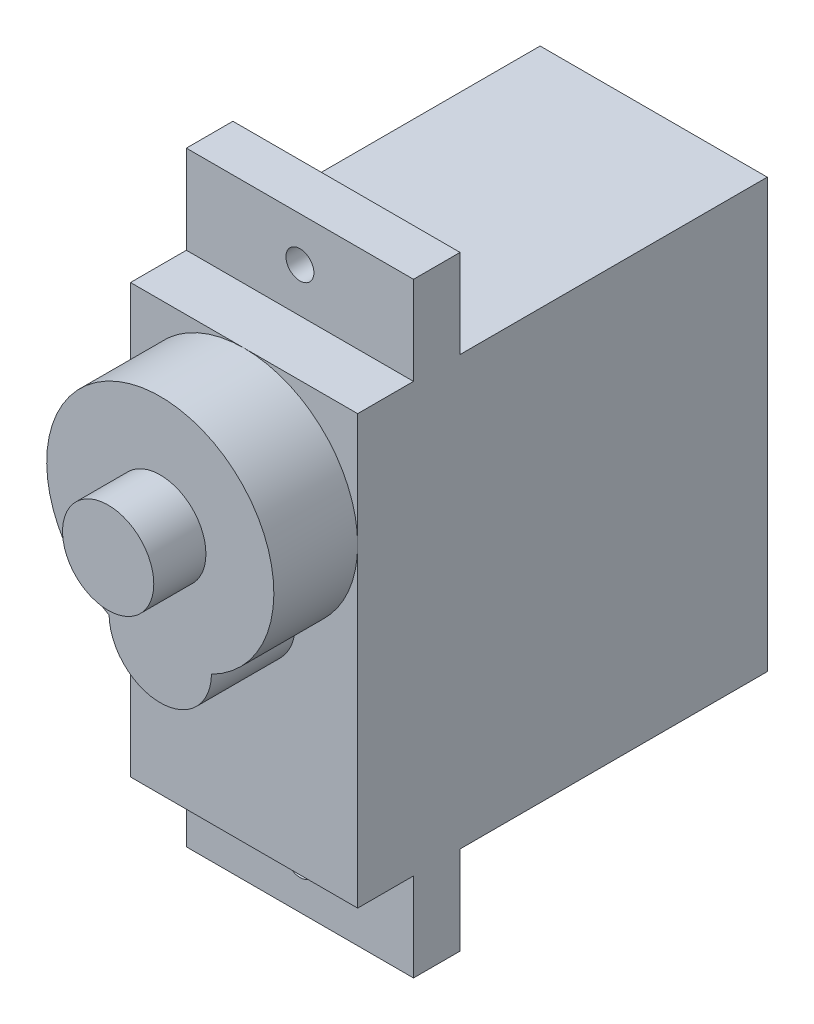
ISO-10303-21;
HEADER;
FILE_DESCRIPTION(('STEP AP214'),'2;1');
FILE_NAME('part.step','',(''),(''),'','','');
FILE_SCHEMA(('AUTOMOTIVE_DESIGN { 1 0 10303 214 1 1 1 1 }'));
ENDSEC;
DATA;
#1=APPLICATION_CONTEXT('core data for automotive mechanical design processes');
#2=APPLICATION_PROTOCOL_DEFINITION('international standard','automotive_design',2000,#1);
#3=PRODUCT_CONTEXT('',#1,'mechanical');
#4=PRODUCT('Part','Part','',(#3));
#5=PRODUCT_RELATED_PRODUCT_CATEGORY('part','',(#4));
#6=PRODUCT_DEFINITION_FORMATION('','',#4);
#7=PRODUCT_DEFINITION_CONTEXT('part definition',#1,'design');
#8=PRODUCT_DEFINITION('design','',#6,#7);
#9=PRODUCT_DEFINITION_SHAPE('','',#8);
#10=(LENGTH_UNIT() NAMED_UNIT(*) SI_UNIT(.MILLI.,.METRE.));
#11=(NAMED_UNIT(*) PLANE_ANGLE_UNIT() SI_UNIT($,.RADIAN.));
#12=(NAMED_UNIT(*) SI_UNIT($,.STERADIAN.) SOLID_ANGLE_UNIT());
#13=UNCERTAINTY_MEASURE_WITH_UNIT(LENGTH_MEASURE(1.E-05),#10,'distance_accuracy_value','');
#14=(GEOMETRIC_REPRESENTATION_CONTEXT(3) GLOBAL_UNCERTAINTY_ASSIGNED_CONTEXT((#13)) GLOBAL_UNIT_ASSIGNED_CONTEXT((#10,
#11,#12)) REPRESENTATION_CONTEXT('',''));
#15=CARTESIAN_POINT('',(0.,0.,0.));
#16=DIRECTION('',(0.,0.,1.));
#17=DIRECTION('',(1.,0.,0.));
#18=AXIS2_PLACEMENT_3D('',#15,#16,#17);
#19=CARTESIAN_POINT('',(6.1,-11.5,-11.));
#20=DIRECTION('',(0.,1.,0.));
#21=DIRECTION('',(0.,0.,1.));
#22=AXIS2_PLACEMENT_3D('',#19,#20,#21);
#23=PLANE('',#22);
#24=DIRECTION('',(-1.,0.,0.));
#25=VECTOR('',#24,1.);
#26=CARTESIAN_POINT('',(6.1,-11.5,8.));
#27=LINE('',#26,#25);
#28=CARTESIAN_POINT('',(6.1,-11.5,8.));
#29=VERTEX_POINT('',#28);
#30=CARTESIAN_POINT('',(-6.1,-11.5,8.));
#31=VERTEX_POINT('',#30);
#32=EDGE_CURVE('E320',#29,#31,#27,.T.);
#33=ORIENTED_EDGE('',*,*,#32,.F.);
#34=DIRECTION('',(0.,0.,-1.));
#35=VECTOR('',#34,1.);
#36=CARTESIAN_POINT('',(6.1,-11.5,-11.));
#37=LINE('',#36,#35);
#38=CARTESIAN_POINT('',(6.1,-11.5,11.));
#39=VERTEX_POINT('',#38);
#40=EDGE_CURVE('E163',#39,#29,#37,.T.);
#41=ORIENTED_EDGE('',*,*,#40,.F.);
#42=DIRECTION('',(-1.,0.,0.));
#43=VECTOR('',#42,1.);
#44=CARTESIAN_POINT('',(6.1,-11.5,11.));
#45=LINE('',#44,#43);
#46=CARTESIAN_POINT('',(-6.1,-11.5,11.));
#47=VERTEX_POINT('',#46);
#48=EDGE_CURVE('E36',#39,#47,#45,.T.);
#49=ORIENTED_EDGE('',*,*,#48,.T.);
#50=DIRECTION('',(0.,0.,-1.));
#51=VECTOR('',#50,1.);
#52=CARTESIAN_POINT('',(-6.1,-11.5,-11.));
#53=LINE('',#52,#51);
#54=EDGE_CURVE('E236',#47,#31,#53,.T.);
#55=ORIENTED_EDGE('',*,*,#54,.T.);
#56=EDGE_LOOP('',(#33,#41,#49,#55));
#57=FACE_BOUND('',#56,.T.);
#58=ADVANCED_FACE('F32',(#57),#23,.F.);
#59=CARTESIAN_POINT('',(6.1,11.5,-11.));
#60=DIRECTION('',(0.,-1.,0.));
#61=DIRECTION('',(0.,0.,-1.));
#62=AXIS2_PLACEMENT_3D('',#59,#60,#61);
#63=PLANE('',#62);
#64=DIRECTION('',(-1.,0.,0.));
#65=VECTOR('',#64,1.);
#66=CARTESIAN_POINT('',(6.1,11.5,8.));
#67=LINE('',#66,#65);
#68=CARTESIAN_POINT('',(6.1,11.5,8.));
#69=VERTEX_POINT('',#68);
#70=CARTESIAN_POINT('',(-6.1,11.5,8.));
#71=VERTEX_POINT('',#70);
#72=EDGE_CURVE('E197',#69,#71,#67,.T.);
#73=ORIENTED_EDGE('',*,*,#72,.T.);
#74=DIRECTION('',(0.,0.,1.));
#75=VECTOR('',#74,1.);
#76=CARTESIAN_POINT('',(-6.1,11.5,-11.));
#77=LINE('',#76,#75);
#78=CARTESIAN_POINT('',(-6.1,11.5,11.));
#79=VERTEX_POINT('',#78);
#80=EDGE_CURVE('E241',#71,#79,#77,.T.);
#81=ORIENTED_EDGE('',*,*,#80,.T.);
#82=DIRECTION('',(-1.,0.,0.));
#83=VECTOR('',#82,1.);
#84=CARTESIAN_POINT('',(6.1,11.5,11.));
#85=LINE('',#84,#83);
#86=CARTESIAN_POINT('',(0.,11.5,11.));
#87=VERTEX_POINT('',#86);
#88=EDGE_CURVE('E231',#87,#79,#85,.T.);
#89=ORIENTED_EDGE('',*,*,#88,.F.);
#90=CARTESIAN_POINT('',(6.1,11.5,11.));
#91=VERTEX_POINT('',#90);
#92=EDGE_CURVE('E244',#91,#87,#85,.T.);
#93=ORIENTED_EDGE('',*,*,#92,.F.);
#94=DIRECTION('',(0.,0.,1.));
#95=VECTOR('',#94,1.);
#96=CARTESIAN_POINT('',(6.1,11.5,-11.));
#97=LINE('',#96,#95);
#98=EDGE_CURVE('E57',#69,#91,#97,.T.);
#99=ORIENTED_EDGE('',*,*,#98,.F.);
#100=EDGE_LOOP('',(#73,#81,#89,#93,#99));
#101=FACE_BOUND('',#100,.T.);
#102=ADVANCED_FACE('F274',(#101),#63,.F.);
#103=DIRECTION('',(-1.,0.,0.));
#104=VECTOR('',#103,1.);
#105=CARTESIAN_POINT('',(6.1,11.5,5.5));
#106=LINE('',#105,#104);
#107=CARTESIAN_POINT('',(6.1,11.5,5.5));
#108=VERTEX_POINT('',#107);
#109=CARTESIAN_POINT('',(-6.1,11.5,5.5));
#110=VERTEX_POINT('',#109);
#111=EDGE_CURVE('E194',#108,#110,#106,.T.);
#112=ORIENTED_EDGE('',*,*,#111,.F.);
#113=CARTESIAN_POINT('',(6.1,11.5,-11.));
#114=VERTEX_POINT('',#113);
#115=EDGE_CURVE('E228',#114,#108,#97,.T.);
#116=ORIENTED_EDGE('',*,*,#115,.F.);
#117=DIRECTION('',(-1.,0.,0.));
#118=VECTOR('',#117,1.);
#119=CARTESIAN_POINT('',(6.1,11.5,-11.));
#120=LINE('',#119,#118);
#121=CARTESIAN_POINT('',(-6.1,11.5,-11.));
#122=VERTEX_POINT('',#121);
#123=EDGE_CURVE('E247',#114,#122,#120,.T.);
#124=ORIENTED_EDGE('',*,*,#123,.T.);
#125=EDGE_CURVE('E242',#122,#110,#77,.T.);
#126=ORIENTED_EDGE('',*,*,#125,.T.);
#127=EDGE_LOOP('',(#112,#116,#124,#126));
#128=FACE_BOUND('',#127,.T.);
#129=ADVANCED_FACE('F307',(#128),#63,.F.);
#130=CARTESIAN_POINT('',(6.1,-11.5,11.));
#131=DIRECTION('',(0.,0.,-1.));
#132=DIRECTION('',(-1.,0.,0.));
#133=AXIS2_PLACEMENT_3D('',#130,#131,#132);
#134=PLANE('',#133);
#135=CARTESIAN_POINT('',(0.,0.,11.));
#136=DIRECTION('',(0.,0.,1.));
#137=DIRECTION('',(1.,0.,0.));
#138=AXIS2_PLACEMENT_3D('',#135,#136,#137);
#139=CIRCLE('',#138,2.75);
#140=CARTESIAN_POINT('',(-2.74962951699132,-0.0451388888888871,11.));
#141=VERTEX_POINT('',#140);
#142=CARTESIAN_POINT('',(2.74962951699131,-0.0451388888888906,11.));
#143=VERTEX_POINT('',#142);
#144=EDGE_CURVE('E201',#141,#143,#139,.T.);
#145=ORIENTED_EDGE('',*,*,#144,.F.);
#146=CARTESIAN_POINT('',(0.,5.4,11.));
#147=DIRECTION('',(0.,0.,1.));
#148=DIRECTION('',(1.,0.,0.));
#149=AXIS2_PLACEMENT_3D('',#146,#147,#148);
#150=CIRCLE('',#149,6.1);
#151=CARTESIAN_POINT('',(-6.1,5.4,11.));
#152=VERTEX_POINT('',#151);
#153=EDGE_CURVE('E214',#152,#141,#150,.T.);
#154=ORIENTED_EDGE('',*,*,#153,.F.);
#155=DIRECTION('',(0.,-1.,0.));
#156=VECTOR('',#155,1.);
#157=CARTESIAN_POINT('',(-6.1,-11.5,11.));
#158=LINE('',#157,#156);
#159=EDGE_CURVE('E220',#152,#47,#158,.T.);
#160=ORIENTED_EDGE('',*,*,#159,.T.);
#161=ORIENTED_EDGE('',*,*,#48,.F.);
#162=DIRECTION('',(0.,-1.,0.));
#163=VECTOR('',#162,1.);
#164=CARTESIAN_POINT('',(6.1,-11.5,11.));
#165=LINE('',#164,#163);
#166=CARTESIAN_POINT('',(6.1,5.4,11.));
#167=VERTEX_POINT('',#166);
#168=EDGE_CURVE('E224',#167,#39,#165,.T.);
#169=ORIENTED_EDGE('',*,*,#168,.F.);
#170=EDGE_CURVE('E207',#143,#167,#150,.T.);
#171=ORIENTED_EDGE('',*,*,#170,.F.);
#172=EDGE_LOOP('',(#145,#154,#160,#161,#169,#171));
#173=FACE_BOUND('',#172,.T.);
#174=ADVANCED_FACE('F270',(#173),#134,.F.);
#175=EDGE_CURVE('E41',#167,#87,#150,.T.);
#176=ORIENTED_EDGE('',*,*,#175,.F.);
#177=EDGE_CURVE('E221',#91,#167,#165,.T.);
#178=ORIENTED_EDGE('',*,*,#177,.F.);
#179=ORIENTED_EDGE('',*,*,#92,.T.);
#180=EDGE_LOOP('',(#176,#178,#179));
#181=FACE_BOUND('',#180,.T.);
#182=ADVANCED_FACE('F268',(#181),#134,.F.);
#183=EDGE_CURVE('E259',#87,#152,#150,.T.);
#184=ORIENTED_EDGE('',*,*,#183,.F.);
#185=ORIENTED_EDGE('',*,*,#88,.T.);
#186=EDGE_CURVE('E232',#79,#152,#158,.T.);
#187=ORIENTED_EDGE('',*,*,#186,.T.);
#188=EDGE_LOOP('',(#184,#185,#187));
#189=FACE_BOUND('',#188,.T.);
#190=ADVANCED_FACE('F34',(#189),#134,.F.);
#191=CARTESIAN_POINT('',(6.1,-11.5,5.5));
#192=VERTEX_POINT('',#191);
#193=CARTESIAN_POINT('',(6.1,-11.5,-11.));
#194=VERTEX_POINT('',#193);
#195=EDGE_CURVE('E223',#192,#194,#37,.T.);
#196=ORIENTED_EDGE('',*,*,#195,.F.);
#197=DIRECTION('',(-1.,0.,0.));
#198=VECTOR('',#197,1.);
#199=CARTESIAN_POINT('',(6.1,-11.5,5.5));
#200=LINE('',#199,#198);
#201=CARTESIAN_POINT('',(-6.1,-11.5,5.5));
#202=VERTEX_POINT('',#201);
#203=EDGE_CURVE('E175',#192,#202,#200,.T.);
#204=ORIENTED_EDGE('',*,*,#203,.T.);
#205=CARTESIAN_POINT('',(-6.1,-11.5,-11.));
#206=VERTEX_POINT('',#205);
#207=EDGE_CURVE('E235',#202,#206,#53,.T.);
#208=ORIENTED_EDGE('',*,*,#207,.T.);
#209=DIRECTION('',(-1.,0.,0.));
#210=VECTOR('',#209,1.);
#211=CARTESIAN_POINT('',(6.1,-11.5,-11.));
#212=LINE('',#211,#210);
#213=EDGE_CURVE('E249',#194,#206,#212,.T.);
#214=ORIENTED_EDGE('',*,*,#213,.F.);
#215=EDGE_LOOP('',(#196,#204,#208,#214));
#216=FACE_BOUND('',#215,.T.);
#217=ADVANCED_FACE('F303',(#216),#23,.F.);
#218=CARTESIAN_POINT('',(6.1,-11.5,-11.));
#219=DIRECTION('',(0.,0.,1.));
#220=DIRECTION('',(1.,0.,0.));
#221=AXIS2_PLACEMENT_3D('',#218,#219,#220);
#222=PLANE('',#221);
#223=DIRECTION('',(0.,1.,0.));
#224=VECTOR('',#223,1.);
#225=CARTESIAN_POINT('',(-6.1,-11.5,-11.));
#226=LINE('',#225,#224);
#227=EDGE_CURVE('E239',#206,#122,#226,.T.);
#228=ORIENTED_EDGE('',*,*,#227,.T.);
#229=ORIENTED_EDGE('',*,*,#123,.F.);
#230=DIRECTION('',(0.,1.,0.));
#231=VECTOR('',#230,1.);
#232=CARTESIAN_POINT('',(6.1,-11.5,-11.));
#233=LINE('',#232,#231);
#234=EDGE_CURVE('E226',#194,#114,#233,.T.);
#235=ORIENTED_EDGE('',*,*,#234,.F.);
#236=ORIENTED_EDGE('',*,*,#213,.T.);
#237=EDGE_LOOP('',(#228,#229,#235,#236));
#238=FACE_BOUND('',#237,.T.);
#239=ADVANCED_FACE('F311',(#238),#222,.F.);
#240=CARTESIAN_POINT('',(6.1,0.,0.));
#241=DIRECTION('',(1.,0.,0.));
#242=DIRECTION('',(0.,0.,-1.));
#243=AXIS2_PLACEMENT_3D('',#240,#241,#242);
#244=PLANE('',#243);
#245=ORIENTED_EDGE('',*,*,#177,.T.);
#246=ORIENTED_EDGE('',*,*,#168,.T.);
#247=ORIENTED_EDGE('',*,*,#40,.T.);
#248=DIRECTION('',(0.,-1.,0.));
#249=VECTOR('',#248,1.);
#250=CARTESIAN_POINT('',(6.1,-11.5,8.));
#251=LINE('',#250,#249);
#252=CARTESIAN_POINT('',(6.1,-16.25,8.));
#253=VERTEX_POINT('',#252);
#254=EDGE_CURVE('E157',#29,#253,#251,.T.);
#255=ORIENTED_EDGE('',*,*,#254,.T.);
#256=DIRECTION('',(0.,0.,-1.));
#257=VECTOR('',#256,1.);
#258=CARTESIAN_POINT('',(6.1,-16.25,8.));
#259=LINE('',#258,#257);
#260=CARTESIAN_POINT('',(6.1,-16.25,5.5));
#261=VERTEX_POINT('',#260);
#262=EDGE_CURVE('E147',#253,#261,#259,.T.);
#263=ORIENTED_EDGE('',*,*,#262,.T.);
#264=DIRECTION('',(0.,1.,0.));
#265=VECTOR('',#264,1.);
#266=CARTESIAN_POINT('',(6.1,-11.5,5.5));
#267=LINE('',#266,#265);
#268=EDGE_CURVE('E156',#261,#192,#267,.T.);
#269=ORIENTED_EDGE('',*,*,#268,.T.);
#270=ORIENTED_EDGE('',*,*,#195,.T.);
#271=ORIENTED_EDGE('',*,*,#234,.T.);
#272=ORIENTED_EDGE('',*,*,#115,.T.);
#273=DIRECTION('',(0.,1.,0.));
#274=VECTOR('',#273,1.);
#275=CARTESIAN_POINT('',(6.1,11.5,5.5));
#276=LINE('',#275,#274);
#277=CARTESIAN_POINT('',(6.1,16.25,5.5));
#278=VERTEX_POINT('',#277);
#279=EDGE_CURVE('E181',#108,#278,#276,.T.);
#280=ORIENTED_EDGE('',*,*,#279,.T.);
#281=DIRECTION('',(0.,0.,1.));
#282=VECTOR('',#281,1.);
#283=CARTESIAN_POINT('',(6.1,16.25,8.));
#284=LINE('',#283,#282);
#285=CARTESIAN_POINT('',(6.1,16.25,8.));
#286=VERTEX_POINT('',#285);
#287=EDGE_CURVE('E184',#278,#286,#284,.T.);
#288=ORIENTED_EDGE('',*,*,#287,.T.);
#289=DIRECTION('',(0.,-1.,0.));
#290=VECTOR('',#289,1.);
#291=CARTESIAN_POINT('',(6.1,11.5,8.));
#292=LINE('',#291,#290);
#293=EDGE_CURVE('E179',#286,#69,#292,.T.);
#294=ORIENTED_EDGE('',*,*,#293,.T.);
#295=ORIENTED_EDGE('',*,*,#98,.T.);
#296=EDGE_LOOP('',(#245,#246,#247,#255,#263,#269,#270,#271,#272,#280,#288,#294,#295));
#297=FACE_BOUND('',#296,.T.);
#298=ADVANCED_FACE('F161',(#297),#244,.T.);
#299=CARTESIAN_POINT('',(-6.1,0.,0.));
#300=DIRECTION('',(1.,0.,0.));
#301=DIRECTION('',(0.,0.,-1.));
#302=AXIS2_PLACEMENT_3D('',#299,#300,#301);
#303=PLANE('',#302);
#304=ORIENTED_EDGE('',*,*,#186,.F.);
#305=ORIENTED_EDGE('',*,*,#80,.F.);
#306=DIRECTION('',(0.,-1.,0.));
#307=VECTOR('',#306,1.);
#308=CARTESIAN_POINT('',(-6.1,11.5,8.));
#309=LINE('',#308,#307);
#310=CARTESIAN_POINT('',(-6.1,16.25,8.));
#311=VERTEX_POINT('',#310);
#312=EDGE_CURVE('E170',#311,#71,#309,.T.);
#313=ORIENTED_EDGE('',*,*,#312,.F.);
#314=DIRECTION('',(0.,0.,1.));
#315=VECTOR('',#314,1.);
#316=CARTESIAN_POINT('',(-6.1,16.25,8.));
#317=LINE('',#316,#315);
#318=CARTESIAN_POINT('',(-6.1,16.25,5.5));
#319=VERTEX_POINT('',#318);
#320=EDGE_CURVE('E182',#319,#311,#317,.T.);
#321=ORIENTED_EDGE('',*,*,#320,.F.);
#322=DIRECTION('',(0.,1.,0.));
#323=VECTOR('',#322,1.);
#324=CARTESIAN_POINT('',(-6.1,11.5,5.5));
#325=LINE('',#324,#323);
#326=EDGE_CURVE('E173',#110,#319,#325,.T.);
#327=ORIENTED_EDGE('',*,*,#326,.F.);
#328=ORIENTED_EDGE('',*,*,#125,.F.);
#329=ORIENTED_EDGE('',*,*,#227,.F.);
#330=ORIENTED_EDGE('',*,*,#207,.F.);
#331=DIRECTION('',(0.,1.,0.));
#332=VECTOR('',#331,1.);
#333=CARTESIAN_POINT('',(-6.1,-11.5,5.5));
#334=LINE('',#333,#332);
#335=CARTESIAN_POINT('',(-6.1,-16.25,5.5));
#336=VERTEX_POINT('',#335);
#337=EDGE_CURVE('E49',#336,#202,#334,.T.);
#338=ORIENTED_EDGE('',*,*,#337,.F.);
#339=DIRECTION('',(0.,0.,-1.));
#340=VECTOR('',#339,1.);
#341=CARTESIAN_POINT('',(-6.1,-16.25,8.));
#342=LINE('',#341,#340);
#343=CARTESIAN_POINT('',(-6.1,-16.25,8.));
#344=VERTEX_POINT('',#343);
#345=EDGE_CURVE('E326',#344,#336,#342,.T.);
#346=ORIENTED_EDGE('',*,*,#345,.F.);
#347=DIRECTION('',(0.,-1.,0.));
#348=VECTOR('',#347,1.);
#349=CARTESIAN_POINT('',(-6.1,-11.5,8.));
#350=LINE('',#349,#348);
#351=EDGE_CURVE('E169',#31,#344,#350,.T.);
#352=ORIENTED_EDGE('',*,*,#351,.F.);
#353=ORIENTED_EDGE('',*,*,#54,.F.);
#354=ORIENTED_EDGE('',*,*,#159,.F.);
#355=EDGE_LOOP('',(#304,#305,#313,#321,#327,#328,#329,#330,#338,#346,#352,#353,#354));
#356=FACE_BOUND('',#355,.T.);
#357=ADVANCED_FACE('F280',(#356),#303,.F.);
#358=CARTESIAN_POINT('',(0.,0.,15.5));
#359=DIRECTION('',(0.,0.,-1.));
#360=DIRECTION('',(-1.,0.,0.));
#361=AXIS2_PLACEMENT_3D('',#358,#359,#360);
#362=CYLINDRICAL_SURFACE('',#361,2.75);
#363=ORIENTED_EDGE('',*,*,#144,.T.);
#364=DIRECTION('',(0.,0.,-1.));
#365=VECTOR('',#364,1.);
#366=CARTESIAN_POINT('',(2.74962951699131,-0.0451388888888906,15.5));
#367=LINE('',#366,#365);
#368=CARTESIAN_POINT('',(2.74962951699131,-0.0451388888888906,15.5));
#369=VERTEX_POINT('',#368);
#370=EDGE_CURVE('E217',#369,#143,#367,.T.);
#371=ORIENTED_EDGE('',*,*,#370,.F.);
#372=CARTESIAN_POINT('',(0.,0.,15.5));
#373=DIRECTION('',(0.,0.,1.));
#374=DIRECTION('',(1.,0.,0.));
#375=AXIS2_PLACEMENT_3D('',#372,#373,#374);
#376=CIRCLE('',#375,2.75);
#377=CARTESIAN_POINT('',(-2.74962951699132,-0.0451388888888871,15.5));
#378=VERTEX_POINT('',#377);
#379=EDGE_CURVE('E203',#378,#369,#376,.T.);
#380=ORIENTED_EDGE('',*,*,#379,.F.);
#381=DIRECTION('',(0.,0.,-1.));
#382=VECTOR('',#381,1.);
#383=CARTESIAN_POINT('',(-2.74962951699132,-0.0451388888888871,15.5));
#384=LINE('',#383,#382);
#385=EDGE_CURVE('E209',#378,#141,#384,.T.);
#386=ORIENTED_EDGE('',*,*,#385,.T.);
#387=EDGE_LOOP('',(#363,#371,#380,#386));
#388=FACE_BOUND('',#387,.T.);
#389=ADVANCED_FACE('F285',(#388),#362,.T.);
#390=CARTESIAN_POINT('',(0.,5.4,15.5));
#391=DIRECTION('',(0.,0.,-1.));
#392=DIRECTION('',(-1.,0.,0.));
#393=AXIS2_PLACEMENT_3D('',#390,#391,#392);
#394=CYLINDRICAL_SURFACE('',#393,6.1);
#395=ORIENTED_EDGE('',*,*,#170,.T.);
#396=ORIENTED_EDGE('',*,*,#175,.T.);
#397=ORIENTED_EDGE('',*,*,#183,.T.);
#398=ORIENTED_EDGE('',*,*,#153,.T.);
#399=ORIENTED_EDGE('',*,*,#385,.F.);
#400=CARTESIAN_POINT('',(0.,5.4,15.5));
#401=DIRECTION('',(0.,0.,1.));
#402=DIRECTION('',(1.,0.,0.));
#403=AXIS2_PLACEMENT_3D('',#400,#401,#402);
#404=CIRCLE('',#403,6.1);
#405=EDGE_CURVE('E206',#369,#378,#404,.T.);
#406=ORIENTED_EDGE('',*,*,#405,.F.);
#407=ORIENTED_EDGE('',*,*,#370,.T.);
#408=EDGE_LOOP('',(#395,#396,#397,#398,#399,#406,#407));
#409=FACE_BOUND('',#408,.T.);
#410=ADVANCED_FACE('F264',(#409),#394,.T.);
#411=CARTESIAN_POINT('',(0.,2.7,15.5));
#412=DIRECTION('',(0.,0.,1.));
#413=DIRECTION('',(1.,0.,0.));
#414=AXIS2_PLACEMENT_3D('',#411,#412,#413);
#415=PLANE('',#414);
#416=CARTESIAN_POINT('',(0.,5.4,15.5));
#417=DIRECTION('',(0.,0.,1.));
#418=DIRECTION('',(1.,0.,0.));
#419=AXIS2_PLACEMENT_3D('',#416,#417,#418);
#420=CIRCLE('',#419,2.45);
#421=CARTESIAN_POINT('',(2.45,5.4,15.5));
#422=VERTEX_POINT('',#421);
#423=EDGE_CURVE('E11',#422,#422,#420,.T.);
#424=ORIENTED_EDGE('',*,*,#423,.F.);
#425=EDGE_LOOP('',(#424));
#426=FACE_BOUND('',#425,.T.);
#427=ORIENTED_EDGE('',*,*,#379,.T.);
#428=ORIENTED_EDGE('',*,*,#405,.T.);
#429=EDGE_LOOP('',(#427,#428));
#430=FACE_BOUND('',#429,.T.);
#431=ADVANCED_FACE('F288',(#426,#430),#415,.T.);
#432=CARTESIAN_POINT('',(0.,5.4,18.3));
#433=DIRECTION('',(0.,0.,-1.));
#434=DIRECTION('',(-1.,0.,0.));
#435=AXIS2_PLACEMENT_3D('',#432,#433,#434);
#436=CYLINDRICAL_SURFACE('',#435,2.45);
#437=CARTESIAN_POINT('',(0.,5.4,18.3));
#438=DIRECTION('',(0.,0.,1.));
#439=DIRECTION('',(1.,0.,0.));
#440=AXIS2_PLACEMENT_3D('',#437,#438,#439);
#441=CIRCLE('',#440,2.45);
#442=CARTESIAN_POINT('',(2.45,5.4,18.3));
#443=VERTEX_POINT('',#442);
#444=EDGE_CURVE('E199',#443,#443,#441,.T.);
#445=ORIENTED_EDGE('',*,*,#444,.F.);
#446=EDGE_LOOP('',(#445));
#447=FACE_BOUND('',#446,.T.);
#448=ORIENTED_EDGE('',*,*,#423,.T.);
#449=EDGE_LOOP('',(#448));
#450=FACE_BOUND('',#449,.T.);
#451=ADVANCED_FACE('F290',(#447,#450),#436,.T.);
#452=CARTESIAN_POINT('',(0.,5.4,18.3));
#453=DIRECTION('',(0.,0.,1.));
#454=DIRECTION('',(1.,0.,0.));
#455=AXIS2_PLACEMENT_3D('',#452,#453,#454);
#456=PLANE('',#455);
#457=ORIENTED_EDGE('',*,*,#444,.T.);
#458=EDGE_LOOP('',(#457));
#459=FACE_BOUND('',#458,.T.);
#460=ADVANCED_FACE('F297',(#459),#456,.T.);
#461=CARTESIAN_POINT('',(6.1,11.5,8.));
#462=DIRECTION('',(0.,0.,-1.));
#463=DIRECTION('',(-1.,0.,0.));
#464=AXIS2_PLACEMENT_3D('',#461,#462,#463);
#465=PLANE('',#464);
#466=CARTESIAN_POINT('',(0.,13.875,8.));
#467=DIRECTION('',(0.,0.,1.));
#468=DIRECTION('',(1.,0.,0.));
#469=AXIS2_PLACEMENT_3D('',#466,#467,#468);
#470=CIRCLE('',#469,0.75);
#471=CARTESIAN_POINT('',(0.75,13.875,8.));
#472=VERTEX_POINT('',#471);
#473=EDGE_CURVE('E333',#472,#472,#470,.T.);
#474=ORIENTED_EDGE('',*,*,#473,.F.);
#475=EDGE_LOOP('',(#474));
#476=FACE_BOUND('',#475,.T.);
#477=ORIENTED_EDGE('',*,*,#312,.T.);
#478=ORIENTED_EDGE('',*,*,#72,.F.);
#479=ORIENTED_EDGE('',*,*,#293,.F.);
#480=DIRECTION('',(-1.,0.,0.));
#481=VECTOR('',#480,1.);
#482=CARTESIAN_POINT('',(6.1,16.25,8.));
#483=LINE('',#482,#481);
#484=EDGE_CURVE('E185',#286,#311,#483,.T.);
#485=ORIENTED_EDGE('',*,*,#484,.T.);
#486=EDGE_LOOP('',(#477,#478,#479,#485));
#487=FACE_BOUND('',#486,.T.);
#488=ADVANCED_FACE('F345',(#476,#487),#465,.F.);
#489=CARTESIAN_POINT('',(6.1,11.5,5.5));
#490=DIRECTION('',(0.,0.,1.));
#491=DIRECTION('',(1.,0.,0.));
#492=AXIS2_PLACEMENT_3D('',#489,#490,#491);
#493=PLANE('',#492);
#494=CARTESIAN_POINT('',(0.,13.875,5.5));
#495=DIRECTION('',(0.,0.,1.));
#496=DIRECTION('',(1.,0.,0.));
#497=AXIS2_PLACEMENT_3D('',#494,#495,#496);
#498=CIRCLE('',#497,0.75);
#499=CARTESIAN_POINT('',(0.75,13.875,5.5));
#500=VERTEX_POINT('',#499);
#501=EDGE_CURVE('E328',#500,#500,#498,.F.);
#502=ORIENTED_EDGE('',*,*,#501,.F.);
#503=EDGE_LOOP('',(#502));
#504=FACE_BOUND('',#503,.T.);
#505=ORIENTED_EDGE('',*,*,#326,.T.);
#506=DIRECTION('',(-1.,0.,0.));
#507=VECTOR('',#506,1.);
#508=CARTESIAN_POINT('',(6.1,16.25,5.5));
#509=LINE('',#508,#507);
#510=EDGE_CURVE('E191',#278,#319,#509,.T.);
#511=ORIENTED_EDGE('',*,*,#510,.F.);
#512=ORIENTED_EDGE('',*,*,#279,.F.);
#513=ORIENTED_EDGE('',*,*,#111,.T.);
#514=EDGE_LOOP('',(#505,#511,#512,#513));
#515=FACE_BOUND('',#514,.T.);
#516=ADVANCED_FACE('F348',(#504,#515),#493,.F.);
#517=CARTESIAN_POINT('',(6.1,16.25,8.));
#518=DIRECTION('',(0.,-1.,0.));
#519=DIRECTION('',(0.,0.,-1.));
#520=AXIS2_PLACEMENT_3D('',#517,#518,#519);
#521=PLANE('',#520);
#522=ORIENTED_EDGE('',*,*,#320,.T.);
#523=ORIENTED_EDGE('',*,*,#484,.F.);
#524=ORIENTED_EDGE('',*,*,#287,.F.);
#525=ORIENTED_EDGE('',*,*,#510,.T.);
#526=EDGE_LOOP('',(#522,#523,#524,#525));
#527=FACE_BOUND('',#526,.T.);
#528=ADVANCED_FACE('F355',(#527),#521,.F.);
#529=CARTESIAN_POINT('',(6.1,-11.5,8.));
#530=DIRECTION('',(0.,0.,-1.));
#531=DIRECTION('',(-1.,0.,0.));
#532=AXIS2_PLACEMENT_3D('',#529,#530,#531);
#533=PLANE('',#532);
#534=CARTESIAN_POINT('',(0.,-13.875,8.));
#535=DIRECTION('',(0.,0.,1.));
#536=DIRECTION('',(1.,0.,0.));
#537=AXIS2_PLACEMENT_3D('',#534,#535,#536);
#538=CIRCLE('',#537,0.75);
#539=CARTESIAN_POINT('',(0.75,-13.875,8.));
#540=VERTEX_POINT('',#539);
#541=EDGE_CURVE('E334',#540,#540,#538,.T.);
#542=ORIENTED_EDGE('',*,*,#541,.F.);
#543=EDGE_LOOP('',(#542));
#544=FACE_BOUND('',#543,.T.);
#545=ORIENTED_EDGE('',*,*,#351,.T.);
#546=DIRECTION('',(-1.,0.,0.));
#547=VECTOR('',#546,1.);
#548=CARTESIAN_POINT('',(6.1,-16.25,8.));
#549=LINE('',#548,#547);
#550=EDGE_CURVE('E151',#253,#344,#549,.T.);
#551=ORIENTED_EDGE('',*,*,#550,.F.);
#552=ORIENTED_EDGE('',*,*,#254,.F.);
#553=ORIENTED_EDGE('',*,*,#32,.T.);
#554=EDGE_LOOP('',(#545,#551,#552,#553));
#555=FACE_BOUND('',#554,.T.);
#556=ADVANCED_FACE('F167',(#544,#555),#533,.F.);
#557=CARTESIAN_POINT('',(6.1,-16.25,8.));
#558=DIRECTION('',(0.,1.,0.));
#559=DIRECTION('',(0.,0.,1.));
#560=AXIS2_PLACEMENT_3D('',#557,#558,#559);
#561=PLANE('',#560);
#562=ORIENTED_EDGE('',*,*,#345,.T.);
#563=DIRECTION('',(-1.,0.,0.));
#564=VECTOR('',#563,1.);
#565=CARTESIAN_POINT('',(6.1,-16.25,5.5));
#566=LINE('',#565,#564);
#567=EDGE_CURVE('E153',#261,#336,#566,.T.);
#568=ORIENTED_EDGE('',*,*,#567,.F.);
#569=ORIENTED_EDGE('',*,*,#262,.F.);
#570=ORIENTED_EDGE('',*,*,#550,.T.);
#571=EDGE_LOOP('',(#562,#568,#569,#570));
#572=FACE_BOUND('',#571,.T.);
#573=ADVANCED_FACE('F149',(#572),#561,.F.);
#574=CARTESIAN_POINT('',(6.1,-11.5,5.5));
#575=DIRECTION('',(0.,0.,1.));
#576=DIRECTION('',(0.,-1.,0.));
#577=AXIS2_PLACEMENT_3D('',#574,#575,#576);
#578=PLANE('',#577);
#579=CARTESIAN_POINT('',(0.,-13.875,5.5));
#580=DIRECTION('',(0.,0.,1.));
#581=DIRECTION('',(0.,-1.,0.));
#582=AXIS2_PLACEMENT_3D('',#579,#580,#581);
#583=CIRCLE('',#582,0.75);
#584=CARTESIAN_POINT('',(0.,-14.625,5.5));
#585=VERTEX_POINT('',#584);
#586=EDGE_CURVE('E330',#585,#585,#583,.F.);
#587=ORIENTED_EDGE('',*,*,#586,.F.);
#588=EDGE_LOOP('',(#587));
#589=FACE_BOUND('',#588,.T.);
#590=ORIENTED_EDGE('',*,*,#337,.T.);
#591=ORIENTED_EDGE('',*,*,#203,.F.);
#592=ORIENTED_EDGE('',*,*,#268,.F.);
#593=ORIENTED_EDGE('',*,*,#567,.T.);
#594=EDGE_LOOP('',(#590,#591,#592,#593));
#595=FACE_BOUND('',#594,.T.);
#596=ADVANCED_FACE('F322',(#589,#595),#578,.F.);
#597=CARTESIAN_POINT('',(0.,-13.875,-11.001));
#598=DIRECTION('',(0.,0.,1.));
#599=DIRECTION('',(1.,0.,0.));
#600=AXIS2_PLACEMENT_3D('',#597,#598,#599);
#601=CYLINDRICAL_SURFACE('',#600,0.75);
#602=ORIENTED_EDGE('',*,*,#541,.T.);
#603=EDGE_LOOP('',(#602));
#604=FACE_BOUND('',#603,.T.);
#605=ORIENTED_EDGE('',*,*,#586,.T.);
#606=EDGE_LOOP('',(#605));
#607=FACE_BOUND('',#606,.T.);
#608=ADVANCED_FACE('F481',(#604,#607),#601,.F.);
#609=CARTESIAN_POINT('',(0.,13.875,-11.001));
#610=DIRECTION('',(0.,0.,1.));
#611=DIRECTION('',(1.,0.,0.));
#612=AXIS2_PLACEMENT_3D('',#609,#610,#611);
#613=CYLINDRICAL_SURFACE('',#612,0.75);
#614=ORIENTED_EDGE('',*,*,#473,.T.);
#615=EDGE_LOOP('',(#614));
#616=FACE_BOUND('',#615,.T.);
#617=ORIENTED_EDGE('',*,*,#501,.T.);
#618=EDGE_LOOP('',(#617));
#619=FACE_BOUND('',#618,.T.);
#620=ADVANCED_FACE('F342',(#616,#619),#613,.F.);
#621=CLOSED_SHELL('',(#58,#102,#129,#174,#182,#190,#217,#239,#298,#357,#389,#410,#431,#451,#460,
#488,#516,#528,#556,#573,#596,#608,#620));
#622=MANIFOLD_SOLID_BREP('B2',#621);
#623=ADVANCED_BREP_SHAPE_REPRESENTATION('',(#18,#622),#14);
#624=SHAPE_DEFINITION_REPRESENTATION(#9,#623);
ENDSEC;
END-ISO-10303-21;
